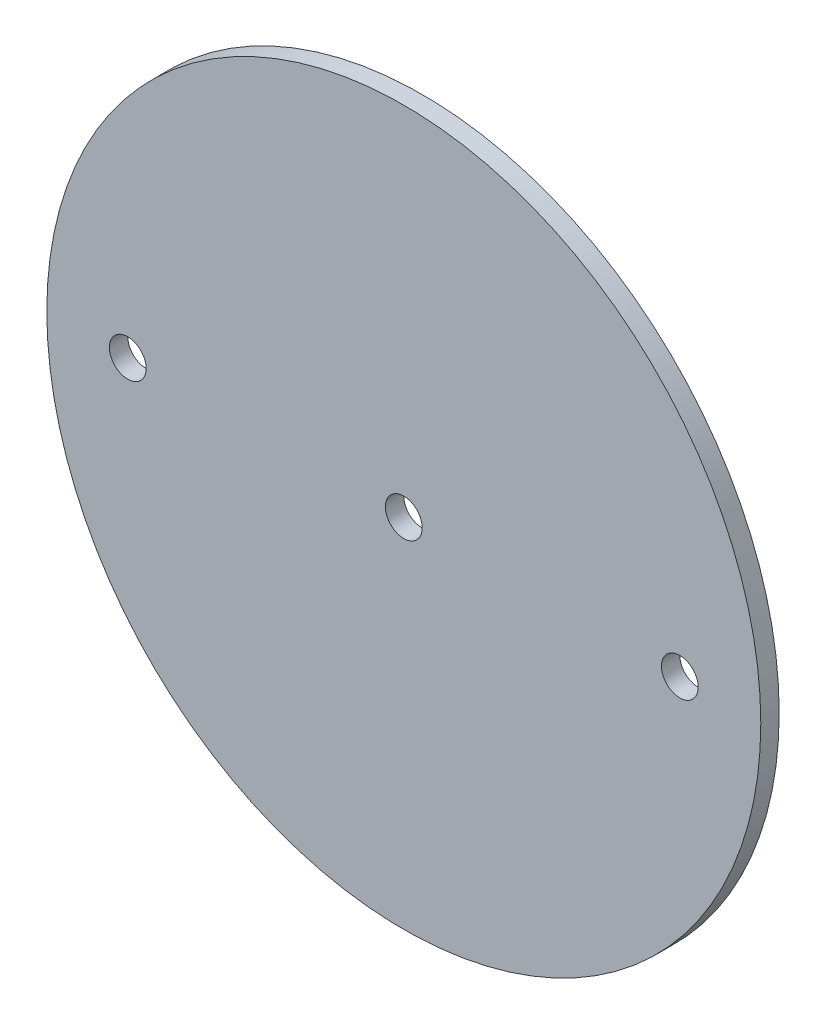
ISO-10303-21;
HEADER;
FILE_DESCRIPTION(('STEP AP214'),'2;1');
FILE_NAME('part.step','',(''),(''),'','','');
FILE_SCHEMA(('AUTOMOTIVE_DESIGN { 1 0 10303 214 1 1 1 1 }'));
ENDSEC;
DATA;
#1=APPLICATION_CONTEXT('core data for automotive mechanical design processes');
#2=APPLICATION_PROTOCOL_DEFINITION('international standard','automotive_design',2000,#1);
#3=PRODUCT_CONTEXT('',#1,'mechanical');
#4=PRODUCT('Part','Part','',(#3));
#5=PRODUCT_RELATED_PRODUCT_CATEGORY('part','',(#4));
#6=PRODUCT_DEFINITION_FORMATION('','',#4);
#7=PRODUCT_DEFINITION_CONTEXT('part definition',#1,'design');
#8=PRODUCT_DEFINITION('design','',#6,#7);
#9=PRODUCT_DEFINITION_SHAPE('','',#8);
#10=(LENGTH_UNIT() NAMED_UNIT(*) SI_UNIT(.MILLI.,.METRE.));
#11=(NAMED_UNIT(*) PLANE_ANGLE_UNIT() SI_UNIT($,.RADIAN.));
#12=(NAMED_UNIT(*) SI_UNIT($,.STERADIAN.) SOLID_ANGLE_UNIT());
#13=UNCERTAINTY_MEASURE_WITH_UNIT(LENGTH_MEASURE(1.E-05),#10,'distance_accuracy_value','');
#14=(GEOMETRIC_REPRESENTATION_CONTEXT(3) GLOBAL_UNCERTAINTY_ASSIGNED_CONTEXT((#13)) GLOBAL_UNIT_ASSIGNED_CONTEXT((#10,
#11,#12)) REPRESENTATION_CONTEXT('',''));
#15=CARTESIAN_POINT('',(0.,0.,0.));
#16=DIRECTION('',(0.,0.,1.));
#17=DIRECTION('',(1.,0.,0.));
#18=AXIS2_PLACEMENT_3D('',#15,#16,#17);
#19=CARTESIAN_POINT('',(0.,0.,1.5875));
#20=DIRECTION('',(0.,0.,-1.));
#21=DIRECTION('',(-1.,0.,0.));
#22=AXIS2_PLACEMENT_3D('',#19,#20,#21);
#23=CYLINDRICAL_SURFACE('',#22,61.595);
#24=CARTESIAN_POINT('',(0.,0.,1.5875));
#25=DIRECTION('',(0.,0.,1.));
#26=DIRECTION('',(1.,0.,0.));
#27=AXIS2_PLACEMENT_3D('',#24,#25,#26);
#28=CIRCLE('',#27,61.595);
#29=CARTESIAN_POINT('',(61.595,0.,1.5875));
#30=VERTEX_POINT('',#29);
#31=EDGE_CURVE('E10',#30,#30,#28,.T.);
#32=ORIENTED_EDGE('',*,*,#31,.F.);
#33=EDGE_LOOP('',(#32));
#34=FACE_BOUND('',#33,.T.);
#35=CARTESIAN_POINT('',(0.,0.,-1.5875));
#36=DIRECTION('',(0.,0.,1.));
#37=DIRECTION('',(1.,0.,0.));
#38=AXIS2_PLACEMENT_3D('',#35,#36,#37);
#39=CIRCLE('',#38,61.595);
#40=CARTESIAN_POINT('',(61.595,0.,-1.5875));
#41=VERTEX_POINT('',#40);
#42=EDGE_CURVE('E40',#41,#41,#39,.T.);
#43=ORIENTED_EDGE('',*,*,#42,.T.);
#44=EDGE_LOOP('',(#43));
#45=FACE_BOUND('',#44,.T.);
#46=ADVANCED_FACE('F37',(#34,#45),#23,.T.);
#47=CARTESIAN_POINT('',(0.,0.,1.5875));
#48=DIRECTION('',(0.,0.,1.));
#49=DIRECTION('',(1.,0.,0.));
#50=AXIS2_PLACEMENT_3D('',#47,#48,#49);
#51=PLANE('',#50);
#52=CARTESIAN_POINT('',(0.,0.,1.5875));
#53=DIRECTION('',(0.,0.,1.));
#54=DIRECTION('',(1.,0.,0.));
#55=AXIS2_PLACEMENT_3D('',#52,#53,#54);
#56=CIRCLE('',#55,3.17499999999999);
#57=CARTESIAN_POINT('',(3.17499999999999,0.,1.5875));
#58=VERTEX_POINT('',#57);
#59=EDGE_CURVE('E63',#58,#58,#56,.T.);
#60=ORIENTED_EDGE('',*,*,#59,.F.);
#61=EDGE_LOOP('',(#60));
#62=FACE_BOUND('',#61,.T.);
#63=CARTESIAN_POINT('',(47.625,0.,1.5875));
#64=DIRECTION('',(0.,0.,1.));
#65=DIRECTION('',(1.,0.,0.));
#66=AXIS2_PLACEMENT_3D('',#63,#64,#65);
#67=CIRCLE('',#66,3.17499999999998);
#68=CARTESIAN_POINT('',(50.8,0.,1.5875));
#69=VERTEX_POINT('',#68);
#70=EDGE_CURVE('E57',#69,#69,#67,.T.);
#71=ORIENTED_EDGE('',*,*,#70,.F.);
#72=EDGE_LOOP('',(#71));
#73=FACE_BOUND('',#72,.T.);
#74=CARTESIAN_POINT('',(-47.625,0.,1.5875));
#75=DIRECTION('',(0.,0.,1.));
#76=DIRECTION('',(1.,0.,0.));
#77=AXIS2_PLACEMENT_3D('',#74,#75,#76);
#78=CIRCLE('',#77,3.17499999999998);
#79=CARTESIAN_POINT('',(-44.45,0.,1.5875));
#80=VERTEX_POINT('',#79);
#81=EDGE_CURVE('E51',#80,#80,#78,.T.);
#82=ORIENTED_EDGE('',*,*,#81,.F.);
#83=EDGE_LOOP('',(#82));
#84=FACE_BOUND('',#83,.T.);
#85=ORIENTED_EDGE('',*,*,#31,.T.);
#86=EDGE_LOOP('',(#85));
#87=FACE_BOUND('',#86,.T.);
#88=ADVANCED_FACE('F69',(#62,#73,#84,#87),#51,.T.);
#89=CARTESIAN_POINT('',(0.,0.,-1.5875));
#90=DIRECTION('',(0.,0.,1.));
#91=DIRECTION('',(1.,0.,0.));
#92=AXIS2_PLACEMENT_3D('',#89,#90,#91);
#93=PLANE('',#92);
#94=CARTESIAN_POINT('',(0.,0.,-1.5875));
#95=DIRECTION('',(0.,0.,1.));
#96=DIRECTION('',(1.,0.,0.));
#97=AXIS2_PLACEMENT_3D('',#94,#95,#96);
#98=CIRCLE('',#97,3.17499999999999);
#99=CARTESIAN_POINT('',(3.17499999999999,0.,-1.5875));
#100=VERTEX_POINT('',#99);
#101=EDGE_CURVE('E60',#100,#100,#98,.T.);
#102=ORIENTED_EDGE('',*,*,#101,.T.);
#103=EDGE_LOOP('',(#102));
#104=FACE_BOUND('',#103,.T.);
#105=CARTESIAN_POINT('',(47.625,0.,-1.5875));
#106=DIRECTION('',(0.,0.,1.));
#107=DIRECTION('',(1.,0.,0.));
#108=AXIS2_PLACEMENT_3D('',#105,#106,#107);
#109=CIRCLE('',#108,3.17499999999999);
#110=CARTESIAN_POINT('',(50.8,0.,-1.5875));
#111=VERTEX_POINT('',#110);
#112=EDGE_CURVE('E54',#111,#111,#109,.T.);
#113=ORIENTED_EDGE('',*,*,#112,.T.);
#114=EDGE_LOOP('',(#113));
#115=FACE_BOUND('',#114,.T.);
#116=CARTESIAN_POINT('',(-47.625,0.,-1.5875));
#117=DIRECTION('',(0.,0.,1.));
#118=DIRECTION('',(1.,0.,0.));
#119=AXIS2_PLACEMENT_3D('',#116,#117,#118);
#120=CIRCLE('',#119,3.17499999999999);
#121=CARTESIAN_POINT('',(-44.45,0.,-1.5875));
#122=VERTEX_POINT('',#121);
#123=EDGE_CURVE('E47',#122,#122,#120,.T.);
#124=ORIENTED_EDGE('',*,*,#123,.T.);
#125=EDGE_LOOP('',(#124));
#126=FACE_BOUND('',#125,.T.);
#127=ORIENTED_EDGE('',*,*,#42,.F.);
#128=EDGE_LOOP('',(#127));
#129=FACE_BOUND('',#128,.T.);
#130=ADVANCED_FACE('F72',(#104,#115,#126,#129),#93,.F.);
#131=CARTESIAN_POINT('',(-47.625,0.,1.5875));
#132=DIRECTION('',(0.,0.,1.));
#133=DIRECTION('',(1.,0.,0.));
#134=AXIS2_PLACEMENT_3D('',#131,#132,#133);
#135=CYLINDRICAL_SURFACE('',#134,3.17499999999999);
#136=ORIENTED_EDGE('',*,*,#123,.F.);
#137=EDGE_LOOP('',(#136));
#138=FACE_BOUND('',#137,.T.);
#139=ORIENTED_EDGE('',*,*,#81,.T.);
#140=EDGE_LOOP('',(#139));
#141=FACE_BOUND('',#140,.T.);
#142=ADVANCED_FACE('F78',(#138,#141),#135,.F.);
#143=CARTESIAN_POINT('',(47.625,0.,1.5875));
#144=DIRECTION('',(0.,0.,1.));
#145=DIRECTION('',(1.,0.,0.));
#146=AXIS2_PLACEMENT_3D('',#143,#144,#145);
#147=CYLINDRICAL_SURFACE('',#146,3.17499999999999);
#148=ORIENTED_EDGE('',*,*,#112,.F.);
#149=EDGE_LOOP('',(#148));
#150=FACE_BOUND('',#149,.T.);
#151=ORIENTED_EDGE('',*,*,#70,.T.);
#152=EDGE_LOOP('',(#151));
#153=FACE_BOUND('',#152,.T.);
#154=ADVANCED_FACE('F80',(#150,#153),#147,.F.);
#155=CARTESIAN_POINT('',(0.,0.,1.5875));
#156=DIRECTION('',(0.,0.,1.));
#157=DIRECTION('',(1.,0.,0.));
#158=AXIS2_PLACEMENT_3D('',#155,#156,#157);
#159=CYLINDRICAL_SURFACE('',#158,3.17499999999999);
#160=ORIENTED_EDGE('',*,*,#101,.F.);
#161=EDGE_LOOP('',(#160));
#162=FACE_BOUND('',#161,.T.);
#163=ORIENTED_EDGE('',*,*,#59,.T.);
#164=EDGE_LOOP('',(#163));
#165=FACE_BOUND('',#164,.T.);
#166=ADVANCED_FACE('F67',(#162,#165),#159,.F.);
#167=CLOSED_SHELL('',(#46,#88,#130,#142,#154,#166));
#168=MANIFOLD_SOLID_BREP('B2',#167);
#169=ADVANCED_BREP_SHAPE_REPRESENTATION('',(#18,#168),#14);
#170=SHAPE_DEFINITION_REPRESENTATION(#9,#169);
ENDSEC;
END-ISO-10303-21;
